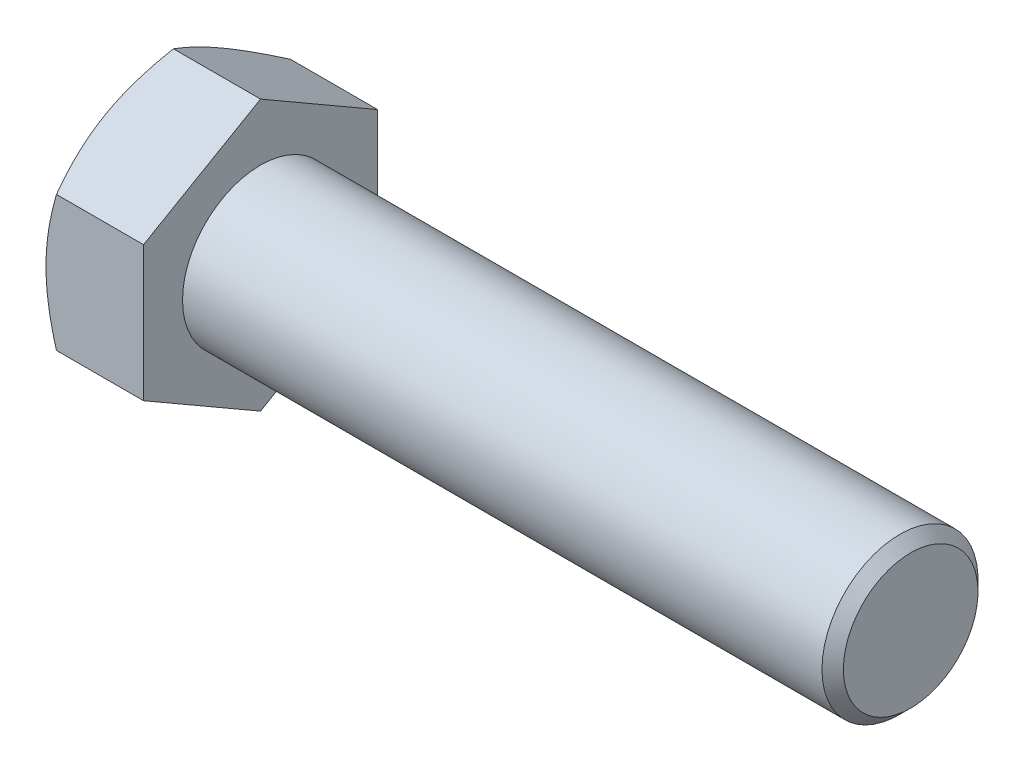
ISO-10303-21;
HEADER;
FILE_DESCRIPTION(('STEP AP214'),'2;1');
FILE_NAME('part.step','',(''),(''),'','','');
FILE_SCHEMA(('AUTOMOTIVE_DESIGN { 1 0 10303 214 1 1 1 1 }'));
ENDSEC;
DATA;
#1=APPLICATION_CONTEXT('core data for automotive mechanical design processes');
#2=APPLICATION_PROTOCOL_DEFINITION('international standard','automotive_design',2000,#1);
#3=PRODUCT_CONTEXT('',#1,'mechanical');
#4=PRODUCT('Part','Part','',(#3));
#5=PRODUCT_RELATED_PRODUCT_CATEGORY('part','',(#4));
#6=PRODUCT_DEFINITION_FORMATION('','',#4);
#7=PRODUCT_DEFINITION_CONTEXT('part definition',#1,'design');
#8=PRODUCT_DEFINITION('design','',#6,#7);
#9=PRODUCT_DEFINITION_SHAPE('','',#8);
#10=(LENGTH_UNIT() NAMED_UNIT(*) SI_UNIT(.MILLI.,.METRE.));
#11=(NAMED_UNIT(*) PLANE_ANGLE_UNIT() SI_UNIT($,.RADIAN.));
#12=(NAMED_UNIT(*) SI_UNIT($,.STERADIAN.) SOLID_ANGLE_UNIT());
#13=UNCERTAINTY_MEASURE_WITH_UNIT(LENGTH_MEASURE(1.E-05),#10,'distance_accuracy_value','');
#14=(GEOMETRIC_REPRESENTATION_CONTEXT(3) GLOBAL_UNCERTAINTY_ASSIGNED_CONTEXT((#13)) GLOBAL_UNIT_ASSIGNED_CONTEXT((#10,
#11,#12)) REPRESENTATION_CONTEXT('',''));
#15=CARTESIAN_POINT('',(0.,0.,0.));
#16=DIRECTION('',(0.,0.,1.));
#17=DIRECTION('',(1.,0.,0.));
#18=AXIS2_PLACEMENT_3D('',#15,#16,#17);
#19=CARTESIAN_POINT('',(15.,10.3923048454132,-18.));
#20=DIRECTION('',(0.,-0.866025403784438,0.500000000000001));
#21=DIRECTION('',(0.,-0.500000000000001,-0.866025403784438));
#22=AXIS2_PLACEMENT_3D('',#19,#20,#21);
#23=PLANE('',#22);
#24=CARTESIAN_POINT('',(1.60776182180895,20.7847251608804,0.000200000000000836));
#25=CARTESIAN_POINT('',(1.47589336556313,20.5563065795853,-0.395432588195887));
#26=CARTESIAN_POINT('',(1.3500088902118,20.3269970432229,-0.792608355835558));
#27=CARTESIAN_POINT('',(1.11187123611099,19.8665391802308,-1.59014476928247));
#28=CARTESIAN_POINT('',(0.999622540659336,19.6353902753093,-1.99050641672051));
#29=CARTESIAN_POINT('',(0.790265297583971,19.1708069369103,-2.79518836317754));
#30=CARTESIAN_POINT('',(0.693192573141017,18.9373684378805,-3.19951570393978));
#31=CARTESIAN_POINT('',(0.516271743787666,18.4688693838575,-4.01097986880547));
#32=CARTESIAN_POINT('',(0.436422652420744,18.2338089225559,-4.41811653063042));
#33=CARTESIAN_POINT('',(0.29734530285486,17.7680889877957,-5.22476711973284));
#34=CARTESIAN_POINT('',(0.237656723113628,17.537464089243,-5.62422116151642));
#35=CARTESIAN_POINT('',(0.137572375669449,17.0751575359747,-6.42495960044929));
#36=CARTESIAN_POINT('',(0.0971769793251374,16.8434758610046,-6.82624403268017));
#37=CARTESIAN_POINT('',(0.0366989588175652,16.3797233284791,-7.62948698115295));
#38=CARTESIAN_POINT('',(0.0165921970388512,16.1476532631882,-8.03144412515262));
#39=CARTESIAN_POINT('',(-0.00287614600259145,15.6832989242254,-8.83572943295137));
#40=CARTESIAN_POINT('',(-0.00223836829112604,15.4510146573942,-9.23805758490178));
#41=CARTESIAN_POINT('',(0.0183335794963781,15.0167538648571,-9.99021934131111));
#42=CARTESIAN_POINT('',(0.0357591844006452,14.8147463980876,-10.3401065372642));
#43=CARTESIAN_POINT('',(0.0859690685012147,14.4112133300948,-11.0390463135619));
#44=CARTESIAN_POINT('',(0.118753127736265,14.209687722012,-11.3880989057876));
#45=CARTESIAN_POINT('',(0.199111057578677,13.8071947240359,-12.0852372279728));
#46=CARTESIAN_POINT('',(0.246698302564822,13.6062280054156,-12.4333217952535));
#47=CARTESIAN_POINT('',(0.355822876567433,13.2052512562621,-13.1278338974413));
#48=CARTESIAN_POINT('',(0.417360146472625,13.0052412216786,-13.4742614393635));
#49=CARTESIAN_POINT('',(0.624462075708551,12.3980849696691,-14.525886915977));
#50=CARTESIAN_POINT('',(0.790677467933134,11.99269701467,-15.228039450812));
#51=CARTESIAN_POINT('',(1.16791817029879,11.1879658503706,-16.6218747138126));
#52=CARTESIAN_POINT('',(1.37885488712769,10.78861233823,-17.3135752870211));
#53=CARTESIAN_POINT('',(1.60776182180894,10.3921893753594,-18.0002));
#54=B_SPLINE_CURVE_WITH_KNOTS('',3,(#24,#25,#26,#27,#28,#29,#30,#31,#32,#33,#34,#35,#36,#37,#38,
#39,#40,#41,#42,#43,#44,#45,#46,#47,#48,#49,#50,#51,#52,#53),.UNSPECIFIED.,.F.,.F.,(4,2,2,2,2,2,
2,2,2,2,2,2,2,2,4),(0.,1.42650335783821,2.85347447244913,4.28376471280638,5.71397301377359,
7.10888071673009,8.50381526803682,9.89708828642551,11.2903182514068,12.5031974791545,
13.7160593367768,14.9300201888636,16.1439758970578,18.6253607678546,21.1018751738864),.UNSPECIFIED.);
#55=CARTESIAN_POINT('',(1.60769515458673,20.7846096908265,0.));
#56=VERTEX_POINT('',#55);
#57=CARTESIAN_POINT('',(0.,15.5884572681199,-9.00000000000002));
#58=VERTEX_POINT('',#57);
#59=EDGE_CURVE('E48',#56,#58,#54,.T.);
#60=ORIENTED_EDGE('',*,*,#59,.F.);
#61=DIRECTION('',(-1.,0.,0.));
#62=VECTOR('',#61,1.);
#63=CARTESIAN_POINT('',(15.,20.7846096908265,0.));
#64=LINE('',#63,#62);
#65=CARTESIAN_POINT('',(15.,20.7846096908265,0.));
#66=VERTEX_POINT('',#65);
#67=EDGE_CURVE('E144',#66,#56,#64,.T.);
#68=ORIENTED_EDGE('',*,*,#67,.F.);
#69=DIRECTION('',(0.,0.500000000000001,0.866025403784438));
#70=VECTOR('',#69,1.);
#71=CARTESIAN_POINT('',(15.,10.3923048454132,-18.));
#72=LINE('',#71,#70);
#73=CARTESIAN_POINT('',(15.,10.3923048454132,-18.));
#74=VERTEX_POINT('',#73);
#75=EDGE_CURVE('E235',#74,#66,#72,.T.);
#76=ORIENTED_EDGE('',*,*,#75,.F.);
#77=DIRECTION('',(-1.,0.,0.));
#78=VECTOR('',#77,1.);
#79=CARTESIAN_POINT('',(15.,10.3923048454132,-18.));
#80=LINE('',#79,#78);
#81=CARTESIAN_POINT('',(1.60769515458672,10.3923048454132,-18.));
#82=VERTEX_POINT('',#81);
#83=EDGE_CURVE('E132',#74,#82,#80,.T.);
#84=ORIENTED_EDGE('',*,*,#83,.T.);
#85=EDGE_CURVE('E126',#58,#82,#54,.T.);
#86=ORIENTED_EDGE('',*,*,#85,.F.);
#87=EDGE_LOOP('',(#60,#68,#76,#84,#86));
#88=FACE_BOUND('',#87,.T.);
#89=ADVANCED_FACE('F32',(#88),#23,.F.);
#90=CARTESIAN_POINT('',(15.,20.7846096908265,0.));
#91=DIRECTION('',(0.,-0.866025403784438,-0.500000000000001));
#92=DIRECTION('',(0.,0.500000000000001,-0.866025403784438));
#93=AXIS2_PLACEMENT_3D('',#90,#91,#92);
#94=PLANE('',#93);
#95=CARTESIAN_POINT('',(1.60776182180894,10.3921893753594,18.0002));
#96=CARTESIAN_POINT('',(1.47589336556312,10.6206079566545,17.6045674118041));
#97=CARTESIAN_POINT('',(1.35000889021179,10.8499174930169,17.2073916441644));
#98=CARTESIAN_POINT('',(1.11187123611098,11.310375356009,16.4098552307175));
#99=CARTESIAN_POINT('',(0.999622540659326,11.5415242609305,16.0094935832795));
#100=CARTESIAN_POINT('',(0.790265297583962,12.0061075993295,15.2048116368225));
#101=CARTESIAN_POINT('',(0.693192573141009,12.2395460983593,14.8004842960602));
#102=CARTESIAN_POINT('',(0.51627174378766,12.7080451523823,13.9890201311945));
#103=CARTESIAN_POINT('',(0.436422652420739,12.9431056136839,13.5818834693696));
#104=CARTESIAN_POINT('',(0.297345302854857,13.4088255484441,12.7752328802672));
#105=CARTESIAN_POINT('',(0.237656723113625,13.6394504469968,12.3757788384836));
#106=CARTESIAN_POINT('',(0.137572375669447,14.1017570002651,11.5750403995507));
#107=CARTESIAN_POINT('',(0.0971769793251351,14.3334386752352,11.1737559673198));
#108=CARTESIAN_POINT('',(0.0366989588175636,14.7971912077607,10.3705130188471));
#109=CARTESIAN_POINT('',(0.0165921970388509,15.0292612730516,9.96855587484738));
#110=CARTESIAN_POINT('',(-0.0028761460025901,15.4936156120144,9.16427056704863));
#111=CARTESIAN_POINT('',(-0.00223836829112426,15.7258998788456,8.76194241509822));
#112=CARTESIAN_POINT('',(0.0183335794963803,16.1601606713826,8.00978065868889));
#113=CARTESIAN_POINT('',(0.0357591844006476,16.3621681381522,7.65989346273577));
#114=CARTESIAN_POINT('',(0.0859690685012189,16.765701206145,6.96095368643809));
#115=CARTESIAN_POINT('',(0.118753127736271,16.9672268142278,6.61190109421242));
#116=CARTESIAN_POINT('',(0.199111057578684,17.3697198122039,5.91476277202716));
#117=CARTESIAN_POINT('',(0.246698302564829,17.5706865308241,5.56667820474646));
#118=CARTESIAN_POINT('',(0.355822876567441,17.9716632799777,4.87216610255867));
#119=CARTESIAN_POINT('',(0.417360146472634,18.1716733145612,4.52573856063651));
#120=CARTESIAN_POINT('',(0.624462075708563,18.7788295665707,3.47411308402299));
#121=CARTESIAN_POINT('',(0.790677467933145,19.1842175215698,2.77196054918801));
#122=CARTESIAN_POINT('',(1.1679181702988,19.9889486858692,1.37812528618742));
#123=CARTESIAN_POINT('',(1.3788548871277,20.3883021980098,0.686424712978885));
#124=CARTESIAN_POINT('',(1.60776182180895,20.7847251608804,-0.000200000000000834));
#125=B_SPLINE_CURVE_WITH_KNOTS('',3,(#95,#96,#97,#98,#99,#100,#101,#102,#103,#104,#105,#106,
#107,#108,#109,#110,#111,#112,#113,#114,#115,#116,#117,#118,#119,#120,#121,#122,#123,#124),
.UNSPECIFIED.,.F.,.F.,(4,2,2,2,2,2,2,2,2,2,2,2,2,2,4),(0.,1.42650335783822,2.85347447244913,
4.28376471280638,5.71397301377359,7.10888071673008,8.50381526803681,9.8970882864255,
11.2903182514068,12.5031974791544,13.7160593367768,14.9300201888636,16.1439758970578,
18.6253607678546,21.1018751738864),.UNSPECIFIED.);
#126=CARTESIAN_POINT('',(1.60769515458672,10.3923048454133,18.));
#127=VERTEX_POINT('',#126);
#128=CARTESIAN_POINT('',(0.,15.5884572681199,9.00000000000002));
#129=VERTEX_POINT('',#128);
#130=EDGE_CURVE('E55',#127,#129,#125,.T.);
#131=ORIENTED_EDGE('',*,*,#130,.F.);
#132=DIRECTION('',(-1.,0.,0.));
#133=VECTOR('',#132,1.);
#134=CARTESIAN_POINT('',(15.,10.3923048454133,18.));
#135=LINE('',#134,#133);
#136=CARTESIAN_POINT('',(15.,10.3923048454133,18.));
#137=VERTEX_POINT('',#136);
#138=EDGE_CURVE('E142',#137,#127,#135,.T.);
#139=ORIENTED_EDGE('',*,*,#138,.F.);
#140=DIRECTION('',(0.,-0.500000000000001,0.866025403784438));
#141=VECTOR('',#140,1.);
#142=CARTESIAN_POINT('',(15.,20.7846096908265,0.));
#143=LINE('',#142,#141);
#144=EDGE_CURVE('E233',#66,#137,#143,.T.);
#145=ORIENTED_EDGE('',*,*,#144,.F.);
#146=ORIENTED_EDGE('',*,*,#67,.T.);
#147=EDGE_CURVE('E159',#129,#56,#125,.T.);
#148=ORIENTED_EDGE('',*,*,#147,.F.);
#149=EDGE_LOOP('',(#131,#139,#145,#146,#148));
#150=FACE_BOUND('',#149,.T.);
#151=ADVANCED_FACE('F165',(#150),#94,.F.);
#152=CARTESIAN_POINT('',(15.,10.3923048454133,18.));
#153=DIRECTION('',(0.,0.,-1.));
#154=DIRECTION('',(0.,1.,0.));
#155=AXIS2_PLACEMENT_3D('',#152,#153,#154);
#156=PLANE('',#155);
#157=CARTESIAN_POINT('',(8.808427130496,-27.9643402431046,18.));
#158=CARTESIAN_POINT('',(8.61750677802229,-27.5710662073959,18.));
#159=CARTESIAN_POINT('',(8.42753472732277,-27.1773320233033,18.));
#160=CARTESIAN_POINT('',(8.04970189891834,-26.3888473520457,18.));
#161=CARTESIAN_POINT('',(7.86184114230335,-25.9940968547769,18.));
#162=CARTESIAN_POINT('',(7.30169863346519,-24.8080724634241,18.));
#163=CARTESIAN_POINT('',(6.93291289399547,-24.0151412252697,18.));
#164=CARTESIAN_POINT('',(6.20490967153255,-22.4196974027513,18.));
#165=CARTESIAN_POINT('',(5.84575478283093,-21.6171561882138,18.));
#166=CARTESIAN_POINT('',(5.14207064659814,-20.0057089274192,18.));
#167=CARTESIAN_POINT('',(4.79754071148437,-19.1968031825104,18.));
#168=CARTESIAN_POINT('',(4.11611022257428,-17.5450041866493,18.));
#169=CARTESIAN_POINT('',(3.77981809482908,-16.7018586270337,18.));
#170=CARTESIAN_POINT('',(3.13256514784992,-15.0057154320914,18.));
#171=CARTESIAN_POINT('',(2.82160716489197,-14.1527167058291,18.));
#172=CARTESIAN_POINT('',(2.23315455016408,-12.43711867356,18.));
#173=CARTESIAN_POINT('',(1.95559259436132,-11.5745426460692,18.));
#174=CARTESIAN_POINT('',(1.44279031196762,-9.83693542713535,18.));
#175=CARTESIAN_POINT('',(1.20753670684013,-8.96190823687535,18.));
#176=CARTESIAN_POINT('',(0.895522308058553,-7.64230427801033,18.));
#177=CARTESIAN_POINT('',(0.798539960307999,-7.20248011867895,18.));
#178=CARTESIAN_POINT('',(0.61934666397991,-6.31981731439132,18.));
#179=CARTESIAN_POINT('',(0.537135413912321,-5.87697873115342,18.));
#180=CARTESIAN_POINT('',(0.388933808123912,-4.98859702789482,18.));
#181=CARTESIAN_POINT('',(0.322942911246029,-4.54305399861045,18.));
#182=CARTESIAN_POINT('',(0.208492383577689,-3.64970631100975,18.));
#183=CARTESIAN_POINT('',(0.160032741349877,-3.20190165416909,18.));
#184=CARTESIAN_POINT('',(0.0822220075298186,-2.31054962941571,18.));
#185=CARTESIAN_POINT('',(0.0526283717185129,-1.86702356479736,18.));
#186=CARTESIAN_POINT('',(0.012226539215199,-0.979118128922018,18.));
#187=CARTESIAN_POINT('',(0.00141802963593598,-0.534738772000976,18.));
#188=CARTESIAN_POINT('',(-0.00115631762080865,0.35407970684775,18.));
#189=CARTESIAN_POINT('',(0.00707792061225486,0.798518829006617,18.));
#190=CARTESIAN_POINT('',(0.0423876675323175,1.68665283494852,18.));
#191=CARTESIAN_POINT('',(0.069464021130165,2.13034768446277,18.));
#192=CARTESIAN_POINT('',(0.156482092926351,3.19520589070312,18.));
#193=CARTESIAN_POINT('',(0.225281528377599,3.81565824171455,18.));
#194=CARTESIAN_POINT('',(0.395990058380339,5.05199420564998,18.));
#195=CARTESIAN_POINT('',(0.497903614582591,5.66787719147405,18.));
#196=CARTESIAN_POINT('',(0.731215030304267,6.89447554273952,18.));
#197=CARTESIAN_POINT('',(0.862635769426437,7.50518651446561,18.));
#198=CARTESIAN_POINT('',(1.15094813703739,8.72049972355144,18.));
#199=CARTESIAN_POINT('',(1.30783938943284,9.3251020509704,18.));
#200=CARTESIAN_POINT('',(1.64698004778297,10.5414936469055,18.));
#201=CARTESIAN_POINT('',(1.82971241990763,11.1531473228725,18.));
#202=CARTESIAN_POINT('',(2.21414736076856,12.3704299751548,18.));
#203=CARTESIAN_POINT('',(2.41585005430054,12.9760589118076,18.));
#204=CARTESIAN_POINT('',(2.83501520647244,14.1815895178699,18.));
#205=CARTESIAN_POINT('',(3.05247247513773,14.7814930003558,18.));
#206=CARTESIAN_POINT('',(3.50057968346486,15.9763233426994,18.));
#207=CARTESIAN_POINT('',(3.73122947137528,16.5712502597116,18.));
#208=CARTESIAN_POINT('',(4.28861115018066,17.9702204857275,18.));
#209=CARTESIAN_POINT('',(4.62002515649325,18.7723954680034,18.));
#210=CARTESIAN_POINT('',(5.29890820133677,20.3699430824083,18.));
#211=CARTESIAN_POINT('',(5.64637822330189,21.1653152943209,18.));
#212=CARTESIAN_POINT('',(6.35417286629493,22.7505167275409,18.));
#213=CARTESIAN_POINT('',(6.7145003341077,23.5403446743747,18.));
#214=CARTESIAN_POINT('',(7.44542750445922,25.1152008413773,18.));
#215=CARTESIAN_POINT('',(7.81602698916609,25.9002291628984,18.));
#216=CARTESIAN_POINT('',(8.56599428613879,27.4671332618931,18.));
#217=CARTESIAN_POINT('',(8.94537123353963,28.2490046594181,18.));
#218=CARTESIAN_POINT('',(9.71100797362349,29.8093695492503,18.));
#219=CARTESIAN_POINT('',(10.0972677957068,30.5878630271109,18.));
#220=CARTESIAN_POINT('',(10.8754456131813,32.1418914548454,18.));
#221=CARTESIAN_POINT('',(11.2673628909044,32.9174267644653,18.));
#222=CARTESIAN_POINT('',(12.0559785801665,34.4660583569055,18.));
#223=CARTESIAN_POINT('',(12.4526769828552,35.2391546442373,18.));
#224=CARTESIAN_POINT('',(13.5822142013125,37.4263866617491,18.));
#225=CARTESIAN_POINT('',(14.3197969559458,38.8380724746762,18.));
#226=CARTESIAN_POINT('',(15.8050655327946,41.6561700073892,18.));
#227=CARTESIAN_POINT('',(16.5527517104897,43.0625815393687,18.));
#228=CARTESIAN_POINT('',(18.0539928572742,45.8677641350797,18.));
#229=CARTESIAN_POINT('',(18.8075285851389,47.2665455031668,18.));
#230=CARTESIAN_POINT('',(19.942334530836,49.3622270652889,18.));
#231=CARTESIAN_POINT('',(20.3213432724281,50.0603536788783,18.));
#232=CARTESIAN_POINT('',(21.0807116459902,51.4558704710998,18.));
#233=CARTESIAN_POINT('',(21.4610712758458,52.1532606508822,18.));
#234=CARTESIAN_POINT('',(21.8420286714726,52.850324235841,18.));
#235=B_SPLINE_CURVE_WITH_KNOTS('',3,(#157,#158,#159,#160,#161,#162,#163,#164,#165,#166,#167,
#168,#169,#170,#171,#172,#173,#174,#175,#176,#177,#178,#179,#180,#181,#182,#183,#184,#185,#186,
#187,#188,#189,#190,#191,#192,#193,#194,#195,#196,#197,#198,#199,#200,#201,#202,#203,#204,#205,
#206,#207,#208,#209,#210,#211,#212,#213,#214,#215,#216,#217,#218,#219,#220,#221,#222,#223,#224,
#225,#226,#227,#228,#229,#230,#231,#232,#233,#234),.UNSPECIFIED.,.F.,.F.,(4,2,2,2,2,2,2,2,2,2,2,
2,2,2,2,2,2,2,2,2,2,2,2,2,2,2,2,2,2,2,2,2,2,2,2,2,2,2,4),(0.,1.31149885283058,2.62301079472824,
5.24642021614437,7.88402931842207,10.5215142775822,13.2444150325257,15.9676202112372,
18.6852401997085,21.4020057650649,22.7529669019192,24.1039004614305,25.4547889438409,
26.8056765449329,28.1388267463276,29.4719547424042,30.8050880527688,32.138281146834,
34.0100119547707,35.8819950561187,37.7554347199951,39.628846723491,41.5435776020437,
43.4583210774805,45.3724366289069,47.286530166998,49.890113594,52.4938567029427,
55.0981799317037,57.7024479744958,60.3095605480866,62.9166842606504,65.5234801070603,
68.1302711287376,72.908489911859,77.6868772522354,82.4533702914907,84.8364880602421,
87.2196021009334),.UNSPECIFIED.);
#236=CARTESIAN_POINT('',(1.60769515458671,-10.3923048454132,18.));
#237=VERTEX_POINT('',#236);
#238=CARTESIAN_POINT('',(0.,0.,18.));
#239=VERTEX_POINT('',#238);
#240=EDGE_CURVE('E245',#237,#239,#235,.T.);
#241=ORIENTED_EDGE('',*,*,#240,.F.);
#242=DIRECTION('',(-1.,0.,0.));
#243=VECTOR('',#242,1.);
#244=CARTESIAN_POINT('',(15.,-10.3923048454132,18.));
#245=LINE('',#244,#243);
#246=CARTESIAN_POINT('',(15.,-10.3923048454132,18.));
#247=VERTEX_POINT('',#246);
#248=EDGE_CURVE('E134',#247,#237,#245,.T.);
#249=ORIENTED_EDGE('',*,*,#248,.F.);
#250=DIRECTION('',(0.,-1.,0.));
#251=VECTOR('',#250,1.);
#252=CARTESIAN_POINT('',(15.,10.3923048454133,18.));
#253=LINE('',#252,#251);
#254=EDGE_CURVE('E229',#137,#247,#253,.T.);
#255=ORIENTED_EDGE('',*,*,#254,.F.);
#256=ORIENTED_EDGE('',*,*,#138,.T.);
#257=EDGE_CURVE('E183',#239,#127,#235,.T.);
#258=ORIENTED_EDGE('',*,*,#257,.F.);
#259=EDGE_LOOP('',(#241,#249,#255,#256,#258));
#260=FACE_BOUND('',#259,.T.);
#261=ADVANCED_FACE('F251',(#260),#156,.F.);
#262=CARTESIAN_POINT('',(15.,-20.7846096908265,0.));
#263=DIRECTION('',(0.,0.866025403784437,-0.500000000000002));
#264=DIRECTION('',(0.,0.500000000000002,0.866025403784438));
#265=AXIS2_PLACEMENT_3D('',#262,#263,#264);
#266=PLANE('',#265);
#267=CARTESIAN_POINT('',(1.60776182180895,-20.7847251608804,-0.000200000000000067));
#268=CARTESIAN_POINT('',(1.47589336556313,-20.5563065795853,0.395432588195888));
#269=CARTESIAN_POINT('',(1.35000889021179,-20.3269970432229,0.79260835583556));
#270=CARTESIAN_POINT('',(1.11187123611098,-19.8665391802308,1.59014476928247));
#271=CARTESIAN_POINT('',(0.999622540659329,-19.6353902753093,1.99050641672051));
#272=CARTESIAN_POINT('',(0.790265297583964,-19.1708069369103,2.79518836317754));
#273=CARTESIAN_POINT('',(0.693192573141011,-18.9373684378805,3.19951570393978));
#274=CARTESIAN_POINT('',(0.516271743787659,-18.4688693838575,4.01097986880547));
#275=CARTESIAN_POINT('',(0.436422652420737,-18.2338089225559,4.41811653063042));
#276=CARTESIAN_POINT('',(0.297345302854853,-17.7680889877957,5.22476711973284));
#277=CARTESIAN_POINT('',(0.237656723113621,-17.537464089243,5.62422116151642));
#278=CARTESIAN_POINT('',(0.137572375669442,-17.0751575359747,6.42495960044928));
#279=CARTESIAN_POINT('',(0.0971769793251287,-16.8434758610045,6.82624403268017));
#280=CARTESIAN_POINT('',(0.0366989588175549,-16.3797233284791,7.62948698115294));
#281=CARTESIAN_POINT('',(0.0165921970388408,-16.1476532631882,8.03144412515262));
#282=CARTESIAN_POINT('',(-0.00287614600260201,-15.6832989242253,8.83572943295136));
#283=CARTESIAN_POINT('',(-0.00223836829113659,-15.4510146573942,9.23805758490178));
#284=CARTESIAN_POINT('',(0.0183335794963686,-15.0167538648571,9.9902193413111));
#285=CARTESIAN_POINT('',(0.0357591844006367,-14.8147463980876,10.3401065372642));
#286=CARTESIAN_POINT('',(0.0859690685012056,-14.4112133300948,11.0390463135619));
#287=CARTESIAN_POINT('',(0.118753127736255,-14.209687722012,11.3880989057876));
#288=CARTESIAN_POINT('',(0.199111057578666,-13.8071947240359,12.0852372279728));
#289=CARTESIAN_POINT('',(0.246698302564811,-13.6062280054156,12.4333217952535));
#290=CARTESIAN_POINT('',(0.355822876567423,-13.205251256262,13.1278338974413));
#291=CARTESIAN_POINT('',(0.417360146472615,-13.0052412216786,13.4742614393635));
#292=CARTESIAN_POINT('',(0.624462075708542,-12.3980849696691,14.525886915977));
#293=CARTESIAN_POINT('',(0.790677467933124,-11.9926970146699,15.228039450812));
#294=CARTESIAN_POINT('',(1.16791817029878,-11.1879658503706,16.6218747138126));
#295=CARTESIAN_POINT('',(1.37885488712768,-10.78861233823,17.3135752870211));
#296=CARTESIAN_POINT('',(1.60776182180893,-10.3921893753594,18.0002));
#297=B_SPLINE_CURVE_WITH_KNOTS('',3,(#267,#268,#269,#270,#271,#272,#273,#274,#275,#276,#277,
#278,#279,#280,#281,#282,#283,#284,#285,#286,#287,#288,#289,#290,#291,#292,#293,#294,#295,#296),
.UNSPECIFIED.,.F.,.F.,(4,2,2,2,2,2,2,2,2,2,2,2,2,2,4),(0.,1.42650335783821,2.85347447244913,
4.28376471280638,5.71397301377359,7.10888071673008,8.50381526803681,9.8970882864255,
11.2903182514068,12.5031974791544,13.7160593367768,14.9300201888636,16.1439758970578,
18.6253607678546,21.1018751738865),.UNSPECIFIED.);
#298=CARTESIAN_POINT('',(1.60769515458673,-20.7846096908265,0.));
#299=VERTEX_POINT('',#298);
#300=CARTESIAN_POINT('',(0.,-15.5884572681199,9.00000000000004));
#301=VERTEX_POINT('',#300);
#302=EDGE_CURVE('E167',#299,#301,#297,.T.);
#303=ORIENTED_EDGE('',*,*,#302,.F.);
#304=DIRECTION('',(-1.,0.,0.));
#305=VECTOR('',#304,1.);
#306=CARTESIAN_POINT('',(15.,-20.7846096908265,0.));
#307=LINE('',#306,#305);
#308=CARTESIAN_POINT('',(15.,-20.7846096908265,0.));
#309=VERTEX_POINT('',#308);
#310=EDGE_CURVE('E131',#309,#299,#307,.T.);
#311=ORIENTED_EDGE('',*,*,#310,.F.);
#312=DIRECTION('',(0.,-0.500000000000002,-0.866025403784437));
#313=VECTOR('',#312,1.);
#314=CARTESIAN_POINT('',(15.,-20.7846096908265,0.));
#315=LINE('',#314,#313);
#316=EDGE_CURVE('E227',#247,#309,#315,.T.);
#317=ORIENTED_EDGE('',*,*,#316,.F.);
#318=ORIENTED_EDGE('',*,*,#248,.T.);
#319=EDGE_CURVE('E169',#301,#237,#297,.T.);
#320=ORIENTED_EDGE('',*,*,#319,.F.);
#321=EDGE_LOOP('',(#303,#311,#317,#318,#320));
#322=FACE_BOUND('',#321,.T.);
#323=ADVANCED_FACE('F223',(#322),#266,.F.);
#324=CARTESIAN_POINT('',(15.,-10.3923048454133,-18.));
#325=DIRECTION('',(0.,0.866025403784439,0.5));
#326=DIRECTION('',(0.,-0.5,0.866025403784439));
#327=AXIS2_PLACEMENT_3D('',#324,#325,#326);
#328=PLANE('',#327);
#329=CARTESIAN_POINT('',(1.60776182180895,-10.3921893753594,-18.0002));
#330=CARTESIAN_POINT('',(1.47589336556313,-10.6206079566545,-17.6045674118041));
#331=CARTESIAN_POINT('',(1.3500088902118,-10.8499174930169,-17.2073916441644));
#332=CARTESIAN_POINT('',(1.11187123611099,-11.310375356009,-16.4098552307175));
#333=CARTESIAN_POINT('',(0.999622540659336,-11.5415242609305,-16.0094935832795));
#334=CARTESIAN_POINT('',(0.790265297583972,-12.0061075993295,-15.2048116368225));
#335=CARTESIAN_POINT('',(0.693192573141018,-12.2395460983593,-14.8004842960602));
#336=CARTESIAN_POINT('',(0.516271743787668,-12.7080451523823,-13.9890201311945));
#337=CARTESIAN_POINT('',(0.436422652420747,-12.9431056136839,-13.5818834693696));
#338=CARTESIAN_POINT('',(0.297345302854864,-13.4088255484441,-12.7752328802672));
#339=CARTESIAN_POINT('',(0.237656723113632,-13.6394504469968,-12.3757788384836));
#340=CARTESIAN_POINT('',(0.137572375669453,-14.1017570002651,-11.5750403995507));
#341=CARTESIAN_POINT('',(0.0971769793251403,-14.3334386752353,-11.1737559673198));
#342=CARTESIAN_POINT('',(0.0366989588175689,-14.7971912077607,-10.370513018847));
#343=CARTESIAN_POINT('',(0.0165921970388565,-15.0292612730516,-9.96855587484737));
#344=CARTESIAN_POINT('',(-0.0028761460025847,-15.4936156120145,-9.16427056704861));
#345=CARTESIAN_POINT('',(-0.00223836829111947,-15.7258998788456,-8.7619424150982));
#346=CARTESIAN_POINT('',(0.0183335794963855,-16.1601606713827,-8.00978065868888));
#347=CARTESIAN_POINT('',(0.0357591844006535,-16.3621681381522,-7.65989346273576));
#348=CARTESIAN_POINT('',(0.085969068501224,-16.765701206145,-6.96095368643808));
#349=CARTESIAN_POINT('',(0.118753127736275,-16.9672268142278,-6.61190109421241));
#350=CARTESIAN_POINT('',(0.199111057578687,-17.3697198122039,-5.91476277202715));
#351=CARTESIAN_POINT('',(0.246698302564833,-17.5706865308241,-5.56667820474646));
#352=CARTESIAN_POINT('',(0.355822876567444,-17.9716632799777,-4.87216610255866));
#353=CARTESIAN_POINT('',(0.417360146472635,-18.1716733145612,-4.5257385606365));
#354=CARTESIAN_POINT('',(0.624462075708559,-18.7788295665707,-3.47411308402298));
#355=CARTESIAN_POINT('',(0.790677467933142,-19.1842175215698,-2.77196054918801));
#356=CARTESIAN_POINT('',(1.16791817029879,-19.9889486858692,-1.37812528618742));
#357=CARTESIAN_POINT('',(1.3788548871277,-20.3883021980098,-0.686424712978884));
#358=CARTESIAN_POINT('',(1.60776182180895,-20.7847251608804,0.000199999999999858));
#359=B_SPLINE_CURVE_WITH_KNOTS('',3,(#329,#330,#331,#332,#333,#334,#335,#336,#337,#338,#339,
#340,#341,#342,#343,#344,#345,#346,#347,#348,#349,#350,#351,#352,#353,#354,#355,#356,#357,#358),
.UNSPECIFIED.,.F.,.F.,(4,2,2,2,2,2,2,2,2,2,2,2,2,2,4),(0.,1.42650335783821,2.85347447244913,
4.28376471280638,5.71397301377359,7.10888071673009,8.50381526803682,9.89708828642551,
11.2903182514068,12.5031974791545,13.7160593367768,14.9300201888636,16.1439758970578,
18.6253607678546,21.1018751738864),.UNSPECIFIED.);
#360=CARTESIAN_POINT('',(1.60769515458673,-10.3923048454133,-18.));
#361=VERTEX_POINT('',#360);
#362=CARTESIAN_POINT('',(0.,-15.5884572681199,-8.99999999999999));
#363=VERTEX_POINT('',#362);
#364=EDGE_CURVE('E108',#361,#363,#359,.T.);
#365=ORIENTED_EDGE('',*,*,#364,.F.);
#366=DIRECTION('',(-1.,0.,0.));
#367=VECTOR('',#366,1.);
#368=CARTESIAN_POINT('',(15.,-10.3923048454133,-18.));
#369=LINE('',#368,#367);
#370=CARTESIAN_POINT('',(15.,-10.3923048454133,-18.));
#371=VERTEX_POINT('',#370);
#372=EDGE_CURVE('E122',#371,#361,#369,.T.);
#373=ORIENTED_EDGE('',*,*,#372,.F.);
#374=DIRECTION('',(0.,0.5,-0.866025403784439));
#375=VECTOR('',#374,1.);
#376=CARTESIAN_POINT('',(15.,-10.3923048454133,-18.));
#377=LINE('',#376,#375);
#378=EDGE_CURVE('E225',#309,#371,#377,.T.);
#379=ORIENTED_EDGE('',*,*,#378,.F.);
#380=ORIENTED_EDGE('',*,*,#310,.T.);
#381=EDGE_CURVE('E125',#363,#299,#359,.T.);
#382=ORIENTED_EDGE('',*,*,#381,.F.);
#383=EDGE_LOOP('',(#365,#373,#379,#380,#382));
#384=FACE_BOUND('',#383,.T.);
#385=ADVANCED_FACE('F120',(#384),#328,.F.);
#386=CARTESIAN_POINT('',(15.,10.3923048454132,-18.));
#387=DIRECTION('',(0.,0.,1.));
#388=DIRECTION('',(0.,-1.,0.));
#389=AXIS2_PLACEMENT_3D('',#386,#387,#388);
#390=PLANE('',#389);
#391=CARTESIAN_POINT('',(8.80842713097472,-27.9643402440907,-18.));
#392=CARTESIAN_POINT('',(8.617506778491,-27.5710662083654,-18.));
#393=CARTESIAN_POINT('',(8.42753472778147,-27.1773320242562,-18.));
#394=CARTESIAN_POINT('',(8.04970189935704,-26.3888473529655,-18.));
#395=CARTESIAN_POINT('',(7.86184114273206,-25.9940968556801,-18.));
#396=CARTESIAN_POINT('',(7.30169863386396,-24.8080724642775,-18.));
#397=CARTESIAN_POINT('',(6.93291289437432,-24.0151412260899,-18.));
#398=CARTESIAN_POINT('',(6.20490967187157,-22.4196974035044,-18.));
#399=CARTESIAN_POINT('',(5.84575478315001,-21.6171561889331,-18.));
#400=CARTESIAN_POINT('',(5.1420706468777,-20.0057089280707,-18.));
#401=CARTESIAN_POINT('',(4.79754071174434,-19.196803183128,-18.));
#402=CARTESIAN_POINT('',(4.11611022279456,-17.5450041871963,-18.));
#403=CARTESIAN_POINT('',(3.7798180950293,-16.7018586275441,-18.));
#404=CARTESIAN_POINT('',(3.1325651480111,-15.005715432528,-18.));
#405=CARTESIAN_POINT('',(2.82160716503417,-14.1527167062286,-18.));
#406=CARTESIAN_POINT('',(2.23315455027017,-12.4371186738844,-18.));
#407=CARTESIAN_POINT('',(1.95559259445028,-11.5745426463558,-18.));
#408=CARTESIAN_POINT('',(1.44279031202514,-9.8369354273451,-18.));
#409=CARTESIAN_POINT('',(1.20753670688334,-8.96190823704618,-18.));
#410=CARTESIAN_POINT('',(0.895522308081286,-7.64230427811239,-18.));
#411=CARTESIAN_POINT('',(0.798539960323235,-7.20248011875153,-18.));
#412=CARTESIAN_POINT('',(0.619346663982096,-6.31981731440452,-18.));
#413=CARTESIAN_POINT('',(0.537135413908953,-5.87697873113672,-18.));
#414=CARTESIAN_POINT('',(0.388933808111684,-4.98859702781801,-18.));
#415=CARTESIAN_POINT('',(0.322942911230495,-4.54305399850343,-18.));
#416=CARTESIAN_POINT('',(0.208492383558031,-3.64970631084204,-18.));
#417=CARTESIAN_POINT('',(0.160032741329401,-3.20190165397091,-18.));
#418=CARTESIAN_POINT('',(0.082222007510393,-2.31054962915723,-18.));
#419=CARTESIAN_POINT('',(0.0526283717009072,-1.86702356450906,-18.));
#420=CARTESIAN_POINT('',(0.0122265392038566,-0.979118128574127,-18.));
#421=CARTESIAN_POINT('',(0.0014180296290367,-0.534738771623327,-18.));
#422=CARTESIAN_POINT('',(-0.00115631761626913,0.354079707284689,-18.));
#423=CARTESIAN_POINT('',(0.00707792062379077,0.798518829473088,-18.));
#424=CARTESIAN_POINT('',(0.0423876675602103,1.68665283547366,-18.));
#425=CARTESIAN_POINT('',(0.0694640211674182,2.13034768501705,-18.));
#426=CARTESIAN_POINT('',(0.156482092986642,3.19520589130288,-18.));
#427=CARTESIAN_POINT('',(0.225281528451191,3.81565824233053,-18.));
#428=CARTESIAN_POINT('',(0.395990058481245,5.05199420629767,-18.));
#429=CARTESIAN_POINT('',(0.49790361469751,5.66787719213724,-18.));
#430=CARTESIAN_POINT('',(0.731215030447439,6.89447554343314,-18.));
#431=CARTESIAN_POINT('',(0.862635769583851,7.50518651517417,-18.));
#432=CARTESIAN_POINT('',(1.15094813722315,8.72049972428945,-18.));
#433=CARTESIAN_POINT('',(1.30783938963271,9.32510205172292,-18.));
#434=CARTESIAN_POINT('',(1.64698004801114,10.5414936476874,-18.));
#435=CARTESIAN_POINT('',(1.82971242014998,11.1531473236693,-18.));
#436=CARTESIAN_POINT('',(2.21414736103885,12.3704299759813,-18.));
#437=CARTESIAN_POINT('',(2.4158500545846,12.9760589126488,-18.));
#438=CARTESIAN_POINT('',(2.83501520678354,14.1815895187405,-18.));
#439=CARTESIAN_POINT('',(3.05247247546212,14.7814930012409,-18.));
#440=CARTESIAN_POINT('',(3.50057968381538,15.9763233436138,-18.));
#441=CARTESIAN_POINT('',(3.73122947173864,16.5712502606406,-18.));
#442=CARTESIAN_POINT('',(4.28861115056411,17.9702204866666,-18.));
#443=CARTESIAN_POINT('',(4.62002515688315,18.7723954689383,-18.));
#444=CARTESIAN_POINT('',(5.29890820173806,20.3699430833353,-18.));
#445=CARTESIAN_POINT('',(5.64637822370813,21.1653152952441,-18.));
#446=CARTESIAN_POINT('',(6.35417286670989,22.750516728457,-18.));
#447=CARTESIAN_POINT('',(6.71450033452646,23.5403446752873,-18.));
#448=CARTESIAN_POINT('',(7.44542750488467,25.1152008422835,-18.));
#449=CARTESIAN_POINT('',(7.81602698959445,25.9002291638017,-18.));
#450=CARTESIAN_POINT('',(8.56599428657223,27.4671332627904,-18.));
#451=CARTESIAN_POINT('',(8.94537123397526,28.2490046603126,-18.));
#452=CARTESIAN_POINT('',(9.71100797406294,29.8093695501392,-18.));
#453=CARTESIAN_POINT('',(10.0972677961478,30.5878630279972,-18.));
#454=CARTESIAN_POINT('',(10.8754456136253,32.1418914557266,-18.));
#455=CARTESIAN_POINT('',(11.2673628913496,32.9174267653441,-18.));
#456=CARTESIAN_POINT('',(12.0559785806139,34.4660583577795,-18.));
#457=CARTESIAN_POINT('',(12.4526769833034,35.239154645109,-18.));
#458=CARTESIAN_POINT('',(13.5822142017647,37.4263866626177,-18.));
#459=CARTESIAN_POINT('',(14.3197969564005,38.8380724755441,-18.));
#460=CARTESIAN_POINT('',(15.805065533254,41.656170008256,-18.));
#461=CARTESIAN_POINT('',(16.5527517109513,43.062581540235,-18.));
#462=CARTESIAN_POINT('',(18.0539928577398,45.8677641359459,-18.));
#463=CARTESIAN_POINT('',(18.8075285856065,47.2665455040334,-18.));
#464=CARTESIAN_POINT('',(19.9423345313063,49.362227066156,-18.));
#465=CARTESIAN_POINT('',(20.3213432728994,50.0603536797457,-18.));
#466=CARTESIAN_POINT('',(21.0807116464631,51.4558704719676,-18.));
#467=CARTESIAN_POINT('',(21.4610712763196,52.1532606517502,-18.));
#468=CARTESIAN_POINT('',(21.8420286719472,52.8503242367093,-18.));
#469=B_SPLINE_CURVE_WITH_KNOTS('',3,(#391,#392,#393,#394,#395,#396,#397,#398,#399,#400,#401,
#402,#403,#404,#405,#406,#407,#408,#409,#410,#411,#412,#413,#414,#415,#416,#417,#418,#419,#420,
#421,#422,#423,#424,#425,#426,#427,#428,#429,#430,#431,#432,#433,#434,#435,#436,#437,#438,#439,
#440,#441,#442,#443,#444,#445,#446,#447,#448,#449,#450,#451,#452,#453,#454,#455,#456,#457,#458,
#459,#460,#461,#462,#463,#464,#465,#466,#467,#468),.UNSPECIFIED.,.F.,.F.,(4,2,2,2,2,2,2,2,2,2,2,
2,2,2,2,2,2,2,2,2,2,2,2,2,2,2,2,2,2,2,2,2,2,2,2,2,2,2,4),(0.,1.31149885288839,2.62301079484386,
5.24642021637564,7.88402931877025,10.5215142780473,13.244415033115,15.9676202119508,
18.6852402005459,21.4020057660261,22.7529669029715,24.1039004625739,25.4547889450755,
26.8056765462585,28.138826747742,29.4719547439074,30.805088054361,32.1382811485151,
34.0100119565044,35.8819950579052,37.7554347218344,39.6288467253831,41.5435776039908,
43.4583210794826,45.3724366309638,47.2865301691098,49.8901135961075,52.4938567050458,
55.0981799338023,57.70244797659,60.3095605501759,62.9166842627348,65.5234801091398,
68.1302711308122,72.9084899139354,77.6868772543136,82.4533702935725,84.8364880623258,
87.219602103019),.UNSPECIFIED.);
#470=CARTESIAN_POINT('',(0.,0.,-18.));
#471=VERTEX_POINT('',#470);
#472=EDGE_CURVE('E114',#82,#471,#469,.F.);
#473=ORIENTED_EDGE('',*,*,#472,.F.);
#474=ORIENTED_EDGE('',*,*,#83,.F.);
#475=DIRECTION('',(0.,1.,0.));
#476=VECTOR('',#475,1.);
#477=CARTESIAN_POINT('',(15.,10.3923048454132,-18.));
#478=LINE('',#477,#476);
#479=EDGE_CURVE('E130',#371,#74,#478,.T.);
#480=ORIENTED_EDGE('',*,*,#479,.F.);
#481=ORIENTED_EDGE('',*,*,#372,.T.);
#482=EDGE_CURVE('E105',#471,#361,#469,.F.);
#483=ORIENTED_EDGE('',*,*,#482,.F.);
#484=EDGE_LOOP('',(#473,#474,#480,#481,#483));
#485=FACE_BOUND('',#484,.T.);
#486=ADVANCED_FACE('F128',(#485),#390,.F.);
#487=CARTESIAN_POINT('',(15.,20.7846096908265,0.));
#488=DIRECTION('',(1.,0.,0.));
#489=DIRECTION('',(0.,0.,-1.));
#490=AXIS2_PLACEMENT_3D('',#487,#488,#489);
#491=PLANE('',#490);
#492=CARTESIAN_POINT('',(15.,0.,0.));
#493=DIRECTION('',(1.,0.,0.));
#494=DIRECTION('',(0.,0.,-1.));
#495=AXIS2_PLACEMENT_3D('',#492,#493,#494);
#496=CIRCLE('',#495,12.);
#497=CARTESIAN_POINT('',(15.,0.,-12.));
#498=VERTEX_POINT('',#497);
#499=EDGE_CURVE('E238',#498,#498,#496,.F.);
#500=ORIENTED_EDGE('',*,*,#499,.T.);
#501=EDGE_LOOP('',(#500));
#502=FACE_BOUND('',#501,.T.);
#503=ORIENTED_EDGE('',*,*,#75,.T.);
#504=ORIENTED_EDGE('',*,*,#144,.T.);
#505=ORIENTED_EDGE('',*,*,#254,.T.);
#506=ORIENTED_EDGE('',*,*,#316,.T.);
#507=ORIENTED_EDGE('',*,*,#378,.T.);
#508=ORIENTED_EDGE('',*,*,#479,.T.);
#509=EDGE_LOOP('',(#503,#504,#505,#506,#507,#508));
#510=FACE_BOUND('',#509,.T.);
#511=ADVANCED_FACE('F253',(#502,#510),#491,.T.);
#512=CARTESIAN_POINT('',(0.,0.,0.));
#513=DIRECTION('',(-1.,0.,0.));
#514=DIRECTION('',(0.,0.,1.));
#515=AXIS2_PLACEMENT_3D('',#512,#513,#514);
#516=CYLINDRICAL_SURFACE('',#515,12.);
#517=ORIENTED_EDGE('',*,*,#499,.F.);
#518=EDGE_LOOP('',(#517));
#519=FACE_BOUND('',#518,.T.);
#520=CARTESIAN_POINT('',(113.352,0.,0.));
#521=DIRECTION('',(-1.,0.,0.));
#522=DIRECTION('',(0.,0.,1.));
#523=AXIS2_PLACEMENT_3D('',#520,#521,#522);
#524=CIRCLE('',#523,12.);
#525=CARTESIAN_POINT('',(113.352,0.,12.));
#526=VERTEX_POINT('',#525);
#527=EDGE_CURVE('E241',#526,#526,#524,.T.);
#528=ORIENTED_EDGE('',*,*,#527,.T.);
#529=EDGE_LOOP('',(#528));
#530=FACE_BOUND('',#529,.T.);
#531=ADVANCED_FACE('F284',(#519,#530),#516,.T.);
#532=CARTESIAN_POINT('',(115.,0.,0.));
#533=DIRECTION('',(-1.,0.,0.));
#534=DIRECTION('',(0.,0.,1.));
#535=AXIS2_PLACEMENT_3D('',#532,#533,#534);
#536=CONICAL_SURFACE('',#535,10.352,0.785398163397441);
#537=ORIENTED_EDGE('',*,*,#527,.F.);
#538=EDGE_LOOP('',(#537));
#539=FACE_BOUND('',#538,.T.);
#540=CARTESIAN_POINT('',(115.,0.,0.));
#541=DIRECTION('',(-1.,0.,0.));
#542=DIRECTION('',(0.,0.,1.));
#543=AXIS2_PLACEMENT_3D('',#540,#541,#542);
#544=CIRCLE('',#543,10.352);
#545=CARTESIAN_POINT('',(115.,0.,10.352));
#546=VERTEX_POINT('',#545);
#547=EDGE_CURVE('E243',#546,#546,#544,.T.);
#548=ORIENTED_EDGE('',*,*,#547,.T.);
#549=EDGE_LOOP('',(#548));
#550=FACE_BOUND('',#549,.T.);
#551=ADVANCED_FACE('F287',(#539,#550),#536,.T.);
#552=CARTESIAN_POINT('',(115.,0.,0.));
#553=DIRECTION('',(-1.,0.,0.));
#554=DIRECTION('',(0.,0.,1.));
#555=AXIS2_PLACEMENT_3D('',#552,#553,#554);
#556=PLANE('',#555);
#557=ORIENTED_EDGE('',*,*,#547,.F.);
#558=EDGE_LOOP('',(#557));
#559=FACE_BOUND('',#558,.T.);
#560=ADVANCED_FACE('F197',(#559),#556,.F.);
#561=CARTESIAN_POINT('',(0.,0.,0.));
#562=DIRECTION('',(1.,0.,0.));
#563=DIRECTION('',(0.,0.,-1.));
#564=AXIS2_PLACEMENT_3D('',#561,#562,#563);
#565=CONICAL_SURFACE('',#564,18.,1.0471975511966);
#566=ORIENTED_EDGE('',*,*,#364,.T.);
#567=CARTESIAN_POINT('',(0.,0.,0.));
#568=DIRECTION('',(1.,0.,0.));
#569=DIRECTION('',(0.,0.,-1.));
#570=AXIS2_PLACEMENT_3D('',#567,#568,#569);
#571=CIRCLE('',#570,18.);
#572=EDGE_CURVE('E36',#363,#471,#571,.T.);
#573=ORIENTED_EDGE('',*,*,#572,.T.);
#574=ORIENTED_EDGE('',*,*,#482,.T.);
#575=EDGE_LOOP('',(#566,#573,#574));
#576=FACE_BOUND('',#575,.T.);
#577=ADVANCED_FACE('F107',(#576),#565,.T.);
#578=ORIENTED_EDGE('',*,*,#302,.T.);
#579=EDGE_CURVE('E149',#301,#363,#571,.T.);
#580=ORIENTED_EDGE('',*,*,#579,.T.);
#581=ORIENTED_EDGE('',*,*,#381,.T.);
#582=EDGE_LOOP('',(#578,#580,#581));
#583=FACE_BOUND('',#582,.T.);
#584=ADVANCED_FACE('F196',(#583),#565,.T.);
#585=ORIENTED_EDGE('',*,*,#240,.T.);
#586=EDGE_CURVE('E150',#239,#301,#571,.T.);
#587=ORIENTED_EDGE('',*,*,#586,.T.);
#588=ORIENTED_EDGE('',*,*,#319,.T.);
#589=EDGE_LOOP('',(#585,#587,#588));
#590=FACE_BOUND('',#589,.T.);
#591=ADVANCED_FACE('F191',(#590),#565,.T.);
#592=ORIENTED_EDGE('',*,*,#257,.T.);
#593=ORIENTED_EDGE('',*,*,#130,.T.);
#594=CARTESIAN_POINT('',(0.,0.,0.));
#595=DIRECTION('',(-1.,0.,0.));
#596=DIRECTION('',(0.,0.,1.));
#597=AXIS2_PLACEMENT_3D('',#594,#595,#596);
#598=CIRCLE('',#597,18.);
#599=EDGE_CURVE('E115',#239,#129,#598,.T.);
#600=ORIENTED_EDGE('',*,*,#599,.F.);
#601=EDGE_LOOP('',(#592,#593,#600));
#602=FACE_BOUND('',#601,.T.);
#603=ADVANCED_FACE('F195',(#602),#565,.T.);
#604=ORIENTED_EDGE('',*,*,#147,.T.);
#605=ORIENTED_EDGE('',*,*,#59,.T.);
#606=EDGE_CURVE('E41',#58,#129,#571,.T.);
#607=ORIENTED_EDGE('',*,*,#606,.T.);
#608=EDGE_LOOP('',(#604,#605,#607));
#609=FACE_BOUND('',#608,.T.);
#610=ADVANCED_FACE('F158',(#609),#565,.T.);
#611=ORIENTED_EDGE('',*,*,#85,.T.);
#612=ORIENTED_EDGE('',*,*,#472,.T.);
#613=EDGE_CURVE('E11',#471,#58,#571,.T.);
#614=ORIENTED_EDGE('',*,*,#613,.T.);
#615=EDGE_LOOP('',(#611,#612,#614));
#616=FACE_BOUND('',#615,.T.);
#617=ADVANCED_FACE('F256',(#616),#565,.T.);
#618=CARTESIAN_POINT('',(0.,20.7846096908265,0.));
#619=DIRECTION('',(1.,0.,0.));
#620=DIRECTION('',(0.,0.,-1.));
#621=AXIS2_PLACEMENT_3D('',#618,#619,#620);
#622=PLANE('',#621);
#623=ORIENTED_EDGE('',*,*,#613,.F.);
#624=ORIENTED_EDGE('',*,*,#572,.F.);
#625=ORIENTED_EDGE('',*,*,#579,.F.);
#626=ORIENTED_EDGE('',*,*,#586,.F.);
#627=ORIENTED_EDGE('',*,*,#599,.T.);
#628=ORIENTED_EDGE('',*,*,#606,.F.);
#629=EDGE_LOOP('',(#623,#624,#625,#626,#627,#628));
#630=FACE_BOUND('',#629,.T.);
#631=ADVANCED_FACE('F162',(#630),#622,.F.);
#632=CLOSED_SHELL('',(#89,#151,#261,#323,#385,#486,#511,#531,#551,#560,#577,#584,#591,#603,#610,
#617,#631));
#633=MANIFOLD_SOLID_BREP('B2',#632);
#634=ADVANCED_BREP_SHAPE_REPRESENTATION('',(#18,#633),#14);
#635=SHAPE_DEFINITION_REPRESENTATION(#9,#634);
ENDSEC;
END-ISO-10303-21;
